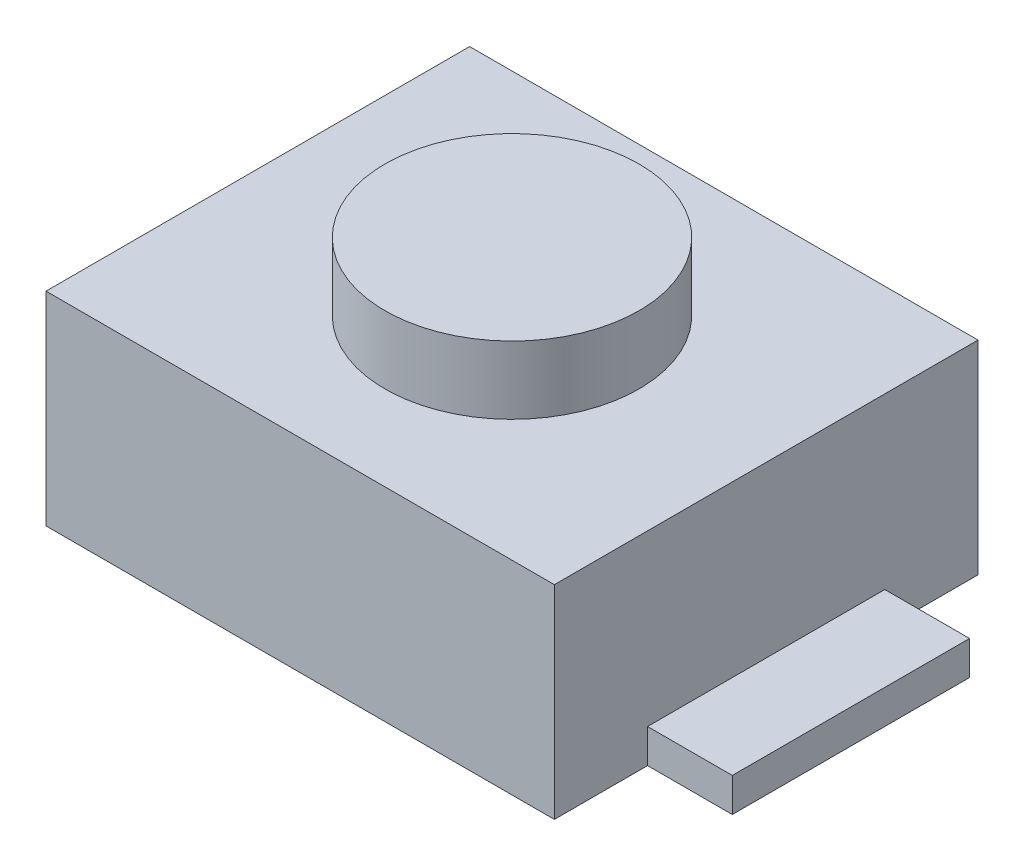
ISO-10303-21;
HEADER;
FILE_DESCRIPTION(('STEP AP214'),'2;1');
FILE_NAME('part.step','',(''),(''),'','','');
FILE_SCHEMA(('AUTOMOTIVE_DESIGN { 1 0 10303 214 1 1 1 1 }'));
ENDSEC;
DATA;
#1=APPLICATION_CONTEXT('core data for automotive mechanical design processes');
#2=APPLICATION_PROTOCOL_DEFINITION('international standard','automotive_design',2000,#1);
#3=PRODUCT_CONTEXT('',#1,'mechanical');
#4=PRODUCT('Part','Part','',(#3));
#5=PRODUCT_RELATED_PRODUCT_CATEGORY('part','',(#4));
#6=PRODUCT_DEFINITION_FORMATION('','',#4);
#7=PRODUCT_DEFINITION_CONTEXT('part definition',#1,'design');
#8=PRODUCT_DEFINITION('design','',#6,#7);
#9=PRODUCT_DEFINITION_SHAPE('','',#8);
#10=(LENGTH_UNIT() NAMED_UNIT(*) SI_UNIT(.MILLI.,.METRE.));
#11=(NAMED_UNIT(*) PLANE_ANGLE_UNIT() SI_UNIT($,.RADIAN.));
#12=(NAMED_UNIT(*) SI_UNIT($,.STERADIAN.) SOLID_ANGLE_UNIT());
#13=UNCERTAINTY_MEASURE_WITH_UNIT(LENGTH_MEASURE(1.E-05),#10,'distance_accuracy_value','');
#14=(GEOMETRIC_REPRESENTATION_CONTEXT(3) GLOBAL_UNCERTAINTY_ASSIGNED_CONTEXT((#13)) GLOBAL_UNIT_ASSIGNED_CONTEXT((#10,
#11,#12)) REPRESENTATION_CONTEXT('',''));
#15=CARTESIAN_POINT('',(0.,0.,0.));
#16=DIRECTION('',(0.,0.,1.));
#17=DIRECTION('',(1.,0.,0.));
#18=AXIS2_PLACEMENT_3D('',#15,#16,#17);
#19=CARTESIAN_POINT('',(-2.,0.,-0.7));
#20=DIRECTION('',(-1.,0.,0.));
#21=DIRECTION('',(0.,0.,1.));
#22=AXIS2_PLACEMENT_3D('',#19,#20,#21);
#23=PLANE('',#22);
#24=DIRECTION('',(0.,0.,1.));
#25=VECTOR('',#24,1.);
#26=CARTESIAN_POINT('',(-2.,0.2,0.));
#27=LINE('',#26,#25);
#28=CARTESIAN_POINT('',(-2.,0.2,-0.7));
#29=VERTEX_POINT('',#28);
#30=CARTESIAN_POINT('',(-2.,0.2,0.7));
#31=VERTEX_POINT('',#30);
#32=EDGE_CURVE('E102',#29,#31,#27,.T.);
#33=ORIENTED_EDGE('',*,*,#32,.F.);
#34=DIRECTION('',(0.,1.,0.));
#35=VECTOR('',#34,1.);
#36=CARTESIAN_POINT('',(-2.,0.1,-0.7));
#37=LINE('',#36,#35);
#38=CARTESIAN_POINT('',(-2.,0.,-0.7));
#39=VERTEX_POINT('',#38);
#40=EDGE_CURVE('E119',#39,#29,#37,.T.);
#41=ORIENTED_EDGE('',*,*,#40,.F.);
#42=DIRECTION('',(0.,0.,-1.));
#43=VECTOR('',#42,1.);
#44=CARTESIAN_POINT('',(-2.,0.,0.));
#45=LINE('',#44,#43);
#46=CARTESIAN_POINT('',(-2.,0.,0.7));
#47=VERTEX_POINT('',#46);
#48=EDGE_CURVE('E108',#47,#39,#45,.T.);
#49=ORIENTED_EDGE('',*,*,#48,.F.);
#50=DIRECTION('',(0.,-1.,0.));
#51=VECTOR('',#50,1.);
#52=CARTESIAN_POINT('',(-2.,0.1,0.7));
#53=LINE('',#52,#51);
#54=EDGE_CURVE('E105',#31,#47,#53,.T.);
#55=ORIENTED_EDGE('',*,*,#54,.F.);
#56=EDGE_LOOP('',(#33,#41,#49,#55));
#57=FACE_BOUND('',#56,.T.);
#58=ADVANCED_FACE('F16',(#57),#23,.T.);
#59=CARTESIAN_POINT('',(2.,0.,0.7));
#60=DIRECTION('',(1.,0.,0.));
#61=DIRECTION('',(0.,0.,-1.));
#62=AXIS2_PLACEMENT_3D('',#59,#60,#61);
#63=PLANE('',#62);
#64=DIRECTION('',(0.,0.,-1.));
#65=VECTOR('',#64,1.);
#66=CARTESIAN_POINT('',(2.,0.2,0.));
#67=LINE('',#66,#65);
#68=CARTESIAN_POINT('',(2.,0.2,0.7));
#69=VERTEX_POINT('',#68);
#70=CARTESIAN_POINT('',(2.,0.2,-0.7));
#71=VERTEX_POINT('',#70);
#72=EDGE_CURVE('E155',#69,#71,#67,.T.);
#73=ORIENTED_EDGE('',*,*,#72,.F.);
#74=DIRECTION('',(0.,1.,0.));
#75=VECTOR('',#74,1.);
#76=CARTESIAN_POINT('',(2.,0.1,0.7));
#77=LINE('',#76,#75);
#78=CARTESIAN_POINT('',(2.,0.,0.7));
#79=VERTEX_POINT('',#78);
#80=EDGE_CURVE('E144',#79,#69,#77,.T.);
#81=ORIENTED_EDGE('',*,*,#80,.F.);
#82=DIRECTION('',(0.,0.,1.));
#83=VECTOR('',#82,1.);
#84=CARTESIAN_POINT('',(2.,0.,0.));
#85=LINE('',#84,#83);
#86=CARTESIAN_POINT('',(2.,0.,-0.7));
#87=VERTEX_POINT('',#86);
#88=EDGE_CURVE('E137',#87,#79,#85,.T.);
#89=ORIENTED_EDGE('',*,*,#88,.F.);
#90=DIRECTION('',(0.,-1.,0.));
#91=VECTOR('',#90,1.);
#92=CARTESIAN_POINT('',(2.,0.1,-0.7));
#93=LINE('',#92,#91);
#94=EDGE_CURVE('E146',#71,#87,#93,.T.);
#95=ORIENTED_EDGE('',*,*,#94,.F.);
#96=EDGE_LOOP('',(#73,#81,#89,#95));
#97=FACE_BOUND('',#96,.T.);
#98=ADVANCED_FACE('F224',(#97),#63,.T.);
#99=CARTESIAN_POINT('',(-2.,0.,0.7));
#100=DIRECTION('',(0.,0.,1.));
#101=DIRECTION('',(1.,0.,0.));
#102=AXIS2_PLACEMENT_3D('',#99,#100,#101);
#103=PLANE('',#102);
#104=ORIENTED_EDGE('',*,*,#54,.T.);
#105=DIRECTION('',(-1.,0.,0.));
#106=VECTOR('',#105,1.);
#107=CARTESIAN_POINT('',(0.,0.,0.7));
#108=LINE('',#107,#106);
#109=CARTESIAN_POINT('',(-1.5,0.,0.7));
#110=VERTEX_POINT('',#109);
#111=EDGE_CURVE('E129',#110,#47,#108,.T.);
#112=ORIENTED_EDGE('',*,*,#111,.F.);
#113=DIRECTION('',(0.,1.,0.));
#114=VECTOR('',#113,1.);
#115=CARTESIAN_POINT('',(-1.5,0.6,0.7));
#116=LINE('',#115,#114);
#117=CARTESIAN_POINT('',(-1.5,0.2000000001,0.7));
#118=VERTEX_POINT('',#117);
#119=EDGE_CURVE('E116',#110,#118,#116,.T.);
#120=ORIENTED_EDGE('',*,*,#119,.T.);
#121=DIRECTION('',(1.,0.,0.));
#122=VECTOR('',#121,1.);
#123=CARTESIAN_POINT('',(-1.75,0.2,0.7));
#124=LINE('',#123,#122);
#125=EDGE_CURVE('E113',#31,#118,#124,.T.);
#126=ORIENTED_EDGE('',*,*,#125,.F.);
#127=EDGE_LOOP('',(#104,#112,#120,#126));
#128=FACE_BOUND('',#127,.T.);
#129=ADVANCED_FACE('F114',(#128),#103,.T.);
#130=CARTESIAN_POINT('',(-2.,0.2,-0.7));
#131=DIRECTION('',(0.,1.,0.));
#132=DIRECTION('',(0.,0.,1.));
#133=AXIS2_PLACEMENT_3D('',#130,#131,#132);
#134=PLANE('',#133);
#135=ORIENTED_EDGE('',*,*,#32,.T.);
#136=ORIENTED_EDGE('',*,*,#125,.T.);
#137=DIRECTION('',(0.,0.,-1.));
#138=VECTOR('',#137,1.);
#139=CARTESIAN_POINT('',(-1.5,0.2000000004,0.));
#140=LINE('',#139,#138);
#141=CARTESIAN_POINT('',(-1.5,0.2000000001,-0.7));
#142=VERTEX_POINT('',#141);
#143=EDGE_CURVE('E170',#118,#142,#140,.T.);
#144=ORIENTED_EDGE('',*,*,#143,.T.);
#145=DIRECTION('',(1.,0.,0.));
#146=VECTOR('',#145,1.);
#147=CARTESIAN_POINT('',(-1.75,0.2,-0.7));
#148=LINE('',#147,#146);
#149=EDGE_CURVE('E123',#29,#142,#148,.T.);
#150=ORIENTED_EDGE('',*,*,#149,.F.);
#151=EDGE_LOOP('',(#135,#136,#144,#150));
#152=FACE_BOUND('',#151,.T.);
#153=ADVANCED_FACE('F121',(#152),#134,.T.);
#154=CARTESIAN_POINT('',(-1.5,0.,-0.7));
#155=DIRECTION('',(0.,0.,-1.));
#156=DIRECTION('',(-1.,0.,0.));
#157=AXIS2_PLACEMENT_3D('',#154,#155,#156);
#158=PLANE('',#157);
#159=ORIENTED_EDGE('',*,*,#40,.T.);
#160=ORIENTED_EDGE('',*,*,#149,.T.);
#161=DIRECTION('',(0.,-1.,0.));
#162=VECTOR('',#161,1.);
#163=CARTESIAN_POINT('',(-1.5,0.6,-0.7));
#164=LINE('',#163,#162);
#165=CARTESIAN_POINT('',(-1.5,0.,-0.7));
#166=VERTEX_POINT('',#165);
#167=EDGE_CURVE('E172',#142,#166,#164,.T.);
#168=ORIENTED_EDGE('',*,*,#167,.T.);
#169=DIRECTION('',(1.,0.,0.));
#170=VECTOR('',#169,1.);
#171=CARTESIAN_POINT('',(0.,0.,-0.7));
#172=LINE('',#171,#170);
#173=EDGE_CURVE('E132',#39,#166,#172,.T.);
#174=ORIENTED_EDGE('',*,*,#173,.F.);
#175=EDGE_LOOP('',(#159,#160,#168,#174));
#176=FACE_BOUND('',#175,.T.);
#177=ADVANCED_FACE('F232',(#176),#158,.T.);
#178=CARTESIAN_POINT('',(-2.,0.,1.25));
#179=DIRECTION('',(0.,-1.,0.));
#180=DIRECTION('',(0.,0.,-1.));
#181=AXIS2_PLACEMENT_3D('',#178,#179,#180);
#182=PLANE('',#181);
#183=DIRECTION('',(0.,0.,1.));
#184=VECTOR('',#183,1.);
#185=CARTESIAN_POINT('',(1.5,0.,0.));
#186=LINE('',#185,#184);
#187=CARTESIAN_POINT('',(1.5,0.,0.7));
#188=VERTEX_POINT('',#187);
#189=CARTESIAN_POINT('',(1.5,0.,1.25));
#190=VERTEX_POINT('',#189);
#191=EDGE_CURVE('E139',#188,#190,#186,.T.);
#192=ORIENTED_EDGE('',*,*,#191,.T.);
#193=DIRECTION('',(-1.,0.,0.));
#194=VECTOR('',#193,1.);
#195=CARTESIAN_POINT('',(0.,0.,1.25));
#196=LINE('',#195,#194);
#197=CARTESIAN_POINT('',(-1.5,0.,1.25));
#198=VERTEX_POINT('',#197);
#199=EDGE_CURVE('E161',#190,#198,#196,.T.);
#200=ORIENTED_EDGE('',*,*,#199,.T.);
#201=DIRECTION('',(0.,0.,-1.));
#202=VECTOR('',#201,1.);
#203=CARTESIAN_POINT('',(-1.5,0.,0.));
#204=LINE('',#203,#202);
#205=EDGE_CURVE('E166',#198,#110,#204,.T.);
#206=ORIENTED_EDGE('',*,*,#205,.T.);
#207=ORIENTED_EDGE('',*,*,#111,.T.);
#208=ORIENTED_EDGE('',*,*,#48,.T.);
#209=ORIENTED_EDGE('',*,*,#173,.T.);
#210=DIRECTION('',(0.,0.,-1.));
#211=VECTOR('',#210,1.);
#212=CARTESIAN_POINT('',(-1.5,0.,0.));
#213=LINE('',#212,#211);
#214=CARTESIAN_POINT('',(-1.5,0.,-1.25));
#215=VERTEX_POINT('',#214);
#216=EDGE_CURVE('E174',#166,#215,#213,.T.);
#217=ORIENTED_EDGE('',*,*,#216,.T.);
#218=DIRECTION('',(1.,0.,0.));
#219=VECTOR('',#218,1.);
#220=CARTESIAN_POINT('',(0.,0.,-1.25));
#221=LINE('',#220,#219);
#222=CARTESIAN_POINT('',(1.5,0.,-1.25));
#223=VERTEX_POINT('',#222);
#224=EDGE_CURVE('E179',#215,#223,#221,.T.);
#225=ORIENTED_EDGE('',*,*,#224,.T.);
#226=DIRECTION('',(0.,0.,1.));
#227=VECTOR('',#226,1.);
#228=CARTESIAN_POINT('',(1.5,0.,0.));
#229=LINE('',#228,#227);
#230=CARTESIAN_POINT('',(1.5,0.,-0.7));
#231=VERTEX_POINT('',#230);
#232=EDGE_CURVE('E135',#223,#231,#229,.T.);
#233=ORIENTED_EDGE('',*,*,#232,.T.);
#234=DIRECTION('',(-1.,0.,0.));
#235=VECTOR('',#234,1.);
#236=CARTESIAN_POINT('',(1.75,0.,-0.7));
#237=LINE('',#236,#235);
#238=EDGE_CURVE('E149',#87,#231,#237,.T.);
#239=ORIENTED_EDGE('',*,*,#238,.F.);
#240=ORIENTED_EDGE('',*,*,#88,.T.);
#241=DIRECTION('',(1.,0.,0.));
#242=VECTOR('',#241,1.);
#243=CARTESIAN_POINT('',(1.75,0.,0.7));
#244=LINE('',#243,#242);
#245=EDGE_CURVE('E141',#188,#79,#244,.T.);
#246=ORIENTED_EDGE('',*,*,#245,.F.);
#247=EDGE_LOOP('',(#192,#200,#206,#207,#208,#209,#217,#225,#233,#239,#240,#246));
#248=FACE_BOUND('',#247,.T.);
#249=ADVANCED_FACE('F235',(#248),#182,.T.);
#250=CARTESIAN_POINT('',(1.5,0.,0.7));
#251=DIRECTION('',(0.,0.,1.));
#252=DIRECTION('',(1.,0.,0.));
#253=AXIS2_PLACEMENT_3D('',#250,#251,#252);
#254=PLANE('',#253);
#255=ORIENTED_EDGE('',*,*,#80,.T.);
#256=DIRECTION('',(1.,0.,0.));
#257=VECTOR('',#256,1.);
#258=CARTESIAN_POINT('',(1.75,0.2,0.7));
#259=LINE('',#258,#257);
#260=CARTESIAN_POINT('',(1.5,0.2000000001,0.7));
#261=VERTEX_POINT('',#260);
#262=EDGE_CURVE('E152',#261,#69,#259,.T.);
#263=ORIENTED_EDGE('',*,*,#262,.F.);
#264=DIRECTION('',(0.,-1.,0.));
#265=VECTOR('',#264,1.);
#266=CARTESIAN_POINT('',(1.5,0.6,0.7));
#267=LINE('',#266,#265);
#268=EDGE_CURVE('E182',#261,#188,#267,.T.);
#269=ORIENTED_EDGE('',*,*,#268,.T.);
#270=ORIENTED_EDGE('',*,*,#245,.T.);
#271=EDGE_LOOP('',(#255,#263,#269,#270));
#272=FACE_BOUND('',#271,.T.);
#273=ADVANCED_FACE('F239',(#272),#254,.T.);
#274=CARTESIAN_POINT('',(2.,0.,-0.7));
#275=DIRECTION('',(0.,0.,-1.));
#276=DIRECTION('',(-1.,0.,0.));
#277=AXIS2_PLACEMENT_3D('',#274,#275,#276);
#278=PLANE('',#277);
#279=ORIENTED_EDGE('',*,*,#94,.T.);
#280=ORIENTED_EDGE('',*,*,#238,.T.);
#281=DIRECTION('',(0.,1.,0.));
#282=VECTOR('',#281,1.);
#283=CARTESIAN_POINT('',(1.5,0.6,-0.7));
#284=LINE('',#283,#282);
#285=CARTESIAN_POINT('',(1.5,0.2000000001,-0.7));
#286=VERTEX_POINT('',#285);
#287=EDGE_CURVE('E189',#231,#286,#284,.T.);
#288=ORIENTED_EDGE('',*,*,#287,.T.);
#289=DIRECTION('',(-1.,0.,0.));
#290=VECTOR('',#289,1.);
#291=CARTESIAN_POINT('',(1.75,0.2,-0.7));
#292=LINE('',#291,#290);
#293=EDGE_CURVE('E158',#71,#286,#292,.T.);
#294=ORIENTED_EDGE('',*,*,#293,.F.);
#295=EDGE_LOOP('',(#279,#280,#288,#294));
#296=FACE_BOUND('',#295,.T.);
#297=ADVANCED_FACE('F243',(#296),#278,.T.);
#298=CARTESIAN_POINT('',(1.5,0.2,-0.7));
#299=DIRECTION('',(0.,1.,0.));
#300=DIRECTION('',(0.,0.,1.));
#301=AXIS2_PLACEMENT_3D('',#298,#299,#300);
#302=PLANE('',#301);
#303=ORIENTED_EDGE('',*,*,#72,.T.);
#304=ORIENTED_EDGE('',*,*,#293,.T.);
#305=DIRECTION('',(0.,0.,1.));
#306=VECTOR('',#305,1.);
#307=CARTESIAN_POINT('',(1.5,0.2000000004,0.));
#308=LINE('',#307,#306);
#309=EDGE_CURVE('E191',#286,#261,#308,.T.);
#310=ORIENTED_EDGE('',*,*,#309,.T.);
#311=ORIENTED_EDGE('',*,*,#262,.T.);
#312=EDGE_LOOP('',(#303,#304,#310,#311));
#313=FACE_BOUND('',#312,.T.);
#314=ADVANCED_FACE('F247',(#313),#302,.T.);
#315=CARTESIAN_POINT('',(1.5,0.,1.25));
#316=DIRECTION('',(0.,0.,-1.));
#317=DIRECTION('',(-1.,0.,0.));
#318=AXIS2_PLACEMENT_3D('',#315,#316,#317);
#319=PLANE('',#318);
#320=DIRECTION('',(0.,1.,0.));
#321=VECTOR('',#320,1.);
#322=CARTESIAN_POINT('',(1.5,0.6,1.25));
#323=LINE('',#322,#321);
#324=CARTESIAN_POINT('',(1.5,1.2,1.25));
#325=VERTEX_POINT('',#324);
#326=EDGE_CURVE('E185',#190,#325,#323,.T.);
#327=ORIENTED_EDGE('',*,*,#326,.T.);
#328=DIRECTION('',(-1.,0.,0.));
#329=VECTOR('',#328,1.);
#330=CARTESIAN_POINT('',(0.,1.2,1.25));
#331=LINE('',#330,#329);
#332=CARTESIAN_POINT('',(-1.5,1.2,1.25));
#333=VERTEX_POINT('',#332);
#334=EDGE_CURVE('E194',#325,#333,#331,.T.);
#335=ORIENTED_EDGE('',*,*,#334,.T.);
#336=DIRECTION('',(0.,-1.,0.));
#337=VECTOR('',#336,1.);
#338=CARTESIAN_POINT('',(-1.5,0.6,1.25));
#339=LINE('',#338,#337);
#340=EDGE_CURVE('E163',#333,#198,#339,.T.);
#341=ORIENTED_EDGE('',*,*,#340,.T.);
#342=ORIENTED_EDGE('',*,*,#199,.F.);
#343=EDGE_LOOP('',(#327,#335,#341,#342));
#344=FACE_BOUND('',#343,.T.);
#345=ADVANCED_FACE('F251',(#344),#319,.F.);
#346=CARTESIAN_POINT('',(-1.5,0.,1.25));
#347=DIRECTION('',(1.,0.,0.));
#348=DIRECTION('',(0.,0.,-1.));
#349=AXIS2_PLACEMENT_3D('',#346,#347,#348);
#350=PLANE('',#349);
#351=ORIENTED_EDGE('',*,*,#167,.F.);
#352=ORIENTED_EDGE('',*,*,#143,.F.);
#353=ORIENTED_EDGE('',*,*,#119,.F.);
#354=ORIENTED_EDGE('',*,*,#205,.F.);
#355=ORIENTED_EDGE('',*,*,#340,.F.);
#356=DIRECTION('',(0.,0.,-1.));
#357=VECTOR('',#356,1.);
#358=CARTESIAN_POINT('',(-1.5,1.2,0.));
#359=LINE('',#358,#357);
#360=CARTESIAN_POINT('',(-1.5,1.2,-1.25));
#361=VERTEX_POINT('',#360);
#362=EDGE_CURVE('E196',#333,#361,#359,.T.);
#363=ORIENTED_EDGE('',*,*,#362,.T.);
#364=DIRECTION('',(0.,-1.,0.));
#365=VECTOR('',#364,1.);
#366=CARTESIAN_POINT('',(-1.5,0.6,-1.25));
#367=LINE('',#366,#365);
#368=EDGE_CURVE('E176',#361,#215,#367,.T.);
#369=ORIENTED_EDGE('',*,*,#368,.T.);
#370=ORIENTED_EDGE('',*,*,#216,.F.);
#371=EDGE_LOOP('',(#351,#352,#353,#354,#355,#363,#369,#370));
#372=FACE_BOUND('',#371,.T.);
#373=ADVANCED_FACE('F255',(#372),#350,.F.);
#374=CARTESIAN_POINT('',(-1.5,0.,-1.25));
#375=DIRECTION('',(0.,0.,1.));
#376=DIRECTION('',(1.,0.,0.));
#377=AXIS2_PLACEMENT_3D('',#374,#375,#376);
#378=PLANE('',#377);
#379=ORIENTED_EDGE('',*,*,#368,.F.);
#380=DIRECTION('',(1.,0.,0.));
#381=VECTOR('',#380,1.);
#382=CARTESIAN_POINT('',(0.,1.2,-1.25));
#383=LINE('',#382,#381);
#384=CARTESIAN_POINT('',(1.5,1.2,-1.25));
#385=VERTEX_POINT('',#384);
#386=EDGE_CURVE('E33',#361,#385,#383,.T.);
#387=ORIENTED_EDGE('',*,*,#386,.T.);
#388=DIRECTION('',(0.,-1.,0.));
#389=VECTOR('',#388,1.);
#390=CARTESIAN_POINT('',(1.5,0.6,-1.25));
#391=LINE('',#390,#389);
#392=EDGE_CURVE('E187',#385,#223,#391,.T.);
#393=ORIENTED_EDGE('',*,*,#392,.T.);
#394=ORIENTED_EDGE('',*,*,#224,.F.);
#395=EDGE_LOOP('',(#379,#387,#393,#394));
#396=FACE_BOUND('',#395,.T.);
#397=ADVANCED_FACE('F259',(#396),#378,.F.);
#398=CARTESIAN_POINT('',(1.5,0.,-1.25));
#399=DIRECTION('',(-1.,0.,0.));
#400=DIRECTION('',(0.,0.,1.));
#401=AXIS2_PLACEMENT_3D('',#398,#399,#400);
#402=PLANE('',#401);
#403=ORIENTED_EDGE('',*,*,#287,.F.);
#404=ORIENTED_EDGE('',*,*,#232,.F.);
#405=ORIENTED_EDGE('',*,*,#392,.F.);
#406=DIRECTION('',(0.,0.,1.));
#407=VECTOR('',#406,1.);
#408=CARTESIAN_POINT('',(1.5,1.2,0.));
#409=LINE('',#408,#407);
#410=EDGE_CURVE('E199',#385,#325,#409,.T.);
#411=ORIENTED_EDGE('',*,*,#410,.T.);
#412=ORIENTED_EDGE('',*,*,#326,.F.);
#413=ORIENTED_EDGE('',*,*,#191,.F.);
#414=ORIENTED_EDGE('',*,*,#268,.F.);
#415=ORIENTED_EDGE('',*,*,#309,.F.);
#416=EDGE_LOOP('',(#403,#404,#405,#411,#412,#413,#414,#415));
#417=FACE_BOUND('',#416,.T.);
#418=ADVANCED_FACE('F263',(#417),#402,.F.);
#419=CARTESIAN_POINT('',(-1.5,1.2,1.25));
#420=DIRECTION('',(0.,-1.,0.));
#421=DIRECTION('',(0.,0.,-1.));
#422=AXIS2_PLACEMENT_3D('',#419,#420,#421);
#423=PLANE('',#422);
#424=CARTESIAN_POINT('',(0.,1.2,0.));
#425=DIRECTION('',(0.,-1.,0.));
#426=DIRECTION('',(0.,0.,-1.));
#427=AXIS2_PLACEMENT_3D('',#424,#425,#426);
#428=CIRCLE('',#427,0.75);
#429=CARTESIAN_POINT('',(0.,1.2,-0.75));
#430=VERTEX_POINT('',#429);
#431=EDGE_CURVE('E20',#430,#430,#428,.T.);
#432=ORIENTED_EDGE('',*,*,#431,.T.);
#433=EDGE_LOOP('',(#432));
#434=FACE_BOUND('',#433,.T.);
#435=ORIENTED_EDGE('',*,*,#386,.F.);
#436=ORIENTED_EDGE('',*,*,#362,.F.);
#437=ORIENTED_EDGE('',*,*,#334,.F.);
#438=ORIENTED_EDGE('',*,*,#410,.F.);
#439=EDGE_LOOP('',(#435,#436,#437,#438));
#440=FACE_BOUND('',#439,.T.);
#441=ADVANCED_FACE('F208',(#434,#440),#423,.F.);
#442=CARTESIAN_POINT('',(-0.759,1.6,-0.759));
#443=DIRECTION('',(0.,1.,0.));
#444=DIRECTION('',(0.,0.,1.));
#445=AXIS2_PLACEMENT_3D('',#442,#443,#444);
#446=PLANE('',#445);
#447=CARTESIAN_POINT('',(0.,1.6,0.));
#448=DIRECTION('',(0.,-1.,0.));
#449=DIRECTION('',(0.,0.,-1.));
#450=AXIS2_PLACEMENT_3D('',#447,#448,#449);
#451=CIRCLE('',#450,0.75);
#452=CARTESIAN_POINT('',(0.,1.6,-0.75));
#453=VERTEX_POINT('',#452);
#454=EDGE_CURVE('E11',#453,#453,#451,.F.);
#455=ORIENTED_EDGE('',*,*,#454,.T.);
#456=EDGE_LOOP('',(#455));
#457=FACE_BOUND('',#456,.T.);
#458=ADVANCED_FACE('F18',(#457),#446,.T.);
#459=CARTESIAN_POINT('',(0.,1.6,0.));
#460=DIRECTION('',(0.,-1.,0.));
#461=DIRECTION('',(0.,0.,-1.));
#462=AXIS2_PLACEMENT_3D('',#459,#460,#461);
#463=CYLINDRICAL_SURFACE('',#462,0.75);
#464=ORIENTED_EDGE('',*,*,#454,.F.);
#465=EDGE_LOOP('',(#464));
#466=FACE_BOUND('',#465,.T.);
#467=ORIENTED_EDGE('',*,*,#431,.F.);
#468=EDGE_LOOP('',(#467));
#469=FACE_BOUND('',#468,.T.);
#470=ADVANCED_FACE('F211',(#466,#469),#463,.T.);
#471=CLOSED_SHELL('',(#58,#98,#129,#153,#177,#249,#273,#297,#314,#345,#373,#397,#418,#441,#458,#470));
#472=MANIFOLD_SOLID_BREP('B1',#471);
#473=ADVANCED_BREP_SHAPE_REPRESENTATION('',(#18,#472),#14);
#474=SHAPE_DEFINITION_REPRESENTATION(#9,#473);
ENDSEC;
END-ISO-10303-21;
